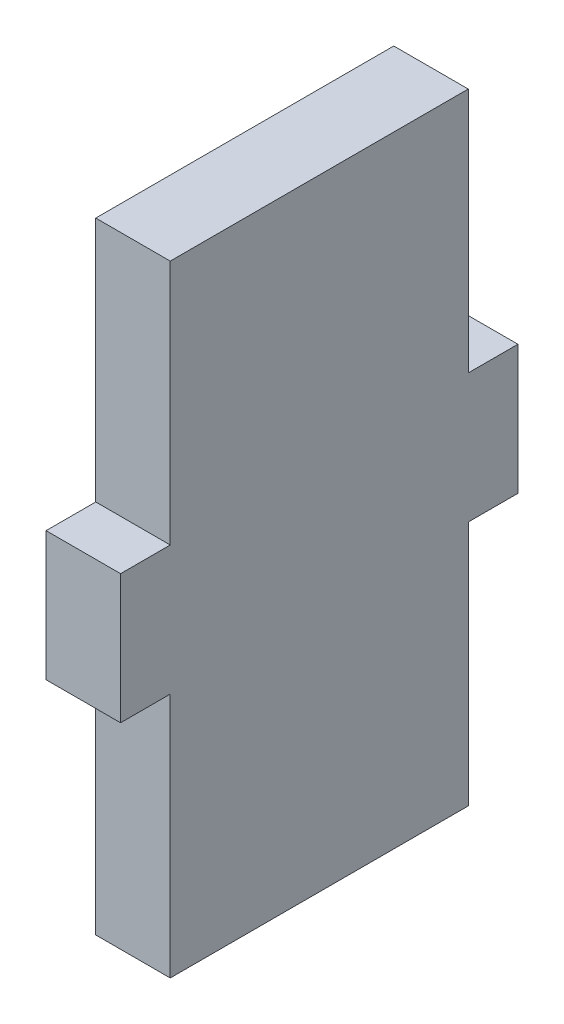
ISO-10303-21;
HEADER;
FILE_DESCRIPTION(('STEP AP214'),'2;1');
FILE_NAME('part.step','',(''),(''),'','','');
FILE_SCHEMA(('AUTOMOTIVE_DESIGN { 1 0 10303 214 1 1 1 1 }'));
ENDSEC;
DATA;
#1=APPLICATION_CONTEXT('core data for automotive mechanical design processes');
#2=APPLICATION_PROTOCOL_DEFINITION('international standard','automotive_design',2000,#1);
#3=PRODUCT_CONTEXT('',#1,'mechanical');
#4=PRODUCT('Part','Part','',(#3));
#5=PRODUCT_RELATED_PRODUCT_CATEGORY('part','',(#4));
#6=PRODUCT_DEFINITION_FORMATION('','',#4);
#7=PRODUCT_DEFINITION_CONTEXT('part definition',#1,'design');
#8=PRODUCT_DEFINITION('design','',#6,#7);
#9=PRODUCT_DEFINITION_SHAPE('','',#8);
#10=(LENGTH_UNIT() NAMED_UNIT(*) SI_UNIT(.MILLI.,.METRE.));
#11=(NAMED_UNIT(*) PLANE_ANGLE_UNIT() SI_UNIT($,.RADIAN.));
#12=(NAMED_UNIT(*) SI_UNIT($,.STERADIAN.) SOLID_ANGLE_UNIT());
#13=UNCERTAINTY_MEASURE_WITH_UNIT(LENGTH_MEASURE(1.E-05),#10,'distance_accuracy_value','');
#14=(GEOMETRIC_REPRESENTATION_CONTEXT(3) GLOBAL_UNCERTAINTY_ASSIGNED_CONTEXT((#13)) GLOBAL_UNIT_ASSIGNED_CONTEXT((#10,
#11,#12)) REPRESENTATION_CONTEXT('',''));
#15=CARTESIAN_POINT('',(0.,0.,0.));
#16=DIRECTION('',(0.,0.,1.));
#17=DIRECTION('',(1.,0.,0.));
#18=AXIS2_PLACEMENT_3D('',#15,#16,#17);
#19=CARTESIAN_POINT('',(435.5,-62.5,-40.000000000001));
#20=DIRECTION('',(0.,0.,1.));
#21=DIRECTION('',(1.,0.,0.));
#22=AXIS2_PLACEMENT_3D('',#19,#20,#21);
#23=PLANE('',#22);
#24=DIRECTION('',(1.,0.,0.));
#25=VECTOR('',#24,1.);
#26=CARTESIAN_POINT('',(392.643223445632,13.0000000000001,-40.000000000001));
#27=LINE('',#26,#25);
#28=CARTESIAN_POINT('',(420.5,13.0000000000001,-40.000000000001));
#29=VERTEX_POINT('',#28);
#30=CARTESIAN_POINT('',(435.5,13.0000000000001,-40.0000000000009));
#31=VERTEX_POINT('',#30);
#32=EDGE_CURVE('E48',#29,#31,#27,.T.);
#33=ORIENTED_EDGE('',*,*,#32,.F.);
#34=DIRECTION('',(0.,1.,0.));
#35=VECTOR('',#34,1.);
#36=CARTESIAN_POINT('',(420.5,-62.5,-40.0000000000011));
#37=LINE('',#36,#35);
#38=CARTESIAN_POINT('',(420.5,62.5,-40.000000000001));
#39=VERTEX_POINT('',#38);
#40=EDGE_CURVE('E190',#29,#39,#37,.T.);
#41=ORIENTED_EDGE('',*,*,#40,.T.);
#42=DIRECTION('',(1.,0.,0.));
#43=VECTOR('',#42,1.);
#44=CARTESIAN_POINT('',(435.5,62.5,-40.000000000001));
#45=LINE('',#44,#43);
#46=CARTESIAN_POINT('',(435.5,62.5,-40.000000000001));
#47=VERTEX_POINT('',#46);
#48=EDGE_CURVE('E122',#39,#47,#45,.T.);
#49=ORIENTED_EDGE('',*,*,#48,.T.);
#50=DIRECTION('',(0.,1.,0.));
#51=VECTOR('',#50,1.);
#52=CARTESIAN_POINT('',(435.5,-62.5,-40.000000000001));
#53=LINE('',#52,#51);
#54=EDGE_CURVE('E41',#31,#47,#53,.T.);
#55=ORIENTED_EDGE('',*,*,#54,.F.);
#56=EDGE_LOOP('',(#33,#41,#49,#55));
#57=FACE_BOUND('',#56,.T.);
#58=ADVANCED_FACE('F33',(#57),#23,.F.);
#59=CARTESIAN_POINT('',(420.5,-62.5,20.));
#60=DIRECTION('',(0.,0.,-1.));
#61=DIRECTION('',(-1.,0.,0.));
#62=AXIS2_PLACEMENT_3D('',#59,#60,#61);
#63=PLANE('',#62);
#64=DIRECTION('',(1.,0.,0.));
#65=VECTOR('',#64,1.);
#66=CARTESIAN_POINT('',(392.643223445632,-13.0000000000001,20.));
#67=LINE('',#66,#65);
#68=CARTESIAN_POINT('',(420.5,-13.0000000000001,20.));
#69=VERTEX_POINT('',#68);
#70=CARTESIAN_POINT('',(435.5,-13.0000000000001,20.0000000000001));
#71=VERTEX_POINT('',#70);
#72=EDGE_CURVE('E175',#69,#71,#67,.T.);
#73=ORIENTED_EDGE('',*,*,#72,.F.);
#74=DIRECTION('',(0.,1.,0.));
#75=VECTOR('',#74,1.);
#76=CARTESIAN_POINT('',(420.5,-62.5,20.));
#77=LINE('',#76,#75);
#78=CARTESIAN_POINT('',(420.5,-62.5,20.));
#79=VERTEX_POINT('',#78);
#80=EDGE_CURVE('E201',#79,#69,#77,.T.);
#81=ORIENTED_EDGE('',*,*,#80,.F.);
#82=DIRECTION('',(-1.,0.,0.));
#83=VECTOR('',#82,1.);
#84=CARTESIAN_POINT('',(420.5,-62.5,20.));
#85=LINE('',#84,#83);
#86=CARTESIAN_POINT('',(435.5,-62.5,20.));
#87=VERTEX_POINT('',#86);
#88=EDGE_CURVE('E186',#87,#79,#85,.T.);
#89=ORIENTED_EDGE('',*,*,#88,.F.);
#90=DIRECTION('',(0.,1.,0.));
#91=VECTOR('',#90,1.);
#92=CARTESIAN_POINT('',(435.5,-62.5,20.));
#93=LINE('',#92,#91);
#94=EDGE_CURVE('E127',#87,#71,#93,.T.);
#95=ORIENTED_EDGE('',*,*,#94,.T.);
#96=EDGE_LOOP('',(#73,#81,#89,#95));
#97=FACE_BOUND('',#96,.T.);
#98=ADVANCED_FACE('F232',(#97),#63,.F.);
#99=CARTESIAN_POINT('',(420.5,-62.5,-40.0000000000011));
#100=VERTEX_POINT('',#99);
#101=CARTESIAN_POINT('',(420.5,-13.0000000000001,-40.0000000000011));
#102=VERTEX_POINT('',#101);
#103=EDGE_CURVE('E56',#100,#102,#37,.T.);
#104=ORIENTED_EDGE('',*,*,#103,.T.);
#105=DIRECTION('',(1.,0.,0.));
#106=VECTOR('',#105,1.);
#107=CARTESIAN_POINT('',(392.643223445632,-13.0000000000001,-40.0000000000011));
#108=LINE('',#107,#106);
#109=CARTESIAN_POINT('',(435.5,-13.0000000000001,-40.000000000001));
#110=VERTEX_POINT('',#109);
#111=EDGE_CURVE('E136',#102,#110,#108,.T.);
#112=ORIENTED_EDGE('',*,*,#111,.T.);
#113=CARTESIAN_POINT('',(435.5,-62.5,-40.000000000001));
#114=VERTEX_POINT('',#113);
#115=EDGE_CURVE('E11',#114,#110,#53,.T.);
#116=ORIENTED_EDGE('',*,*,#115,.F.);
#117=DIRECTION('',(1.,0.,0.));
#118=VECTOR('',#117,1.);
#119=CARTESIAN_POINT('',(435.5,-62.5,-40.000000000001));
#120=LINE('',#119,#118);
#121=EDGE_CURVE('E180',#100,#114,#120,.T.);
#122=ORIENTED_EDGE('',*,*,#121,.F.);
#123=EDGE_LOOP('',(#104,#112,#116,#122));
#124=FACE_BOUND('',#123,.T.);
#125=ADVANCED_FACE('F35',(#124),#23,.F.);
#126=CARTESIAN_POINT('',(435.5,-62.5,-40.000000000001));
#127=DIRECTION('',(-1.,0.,0.));
#128=DIRECTION('',(0.,0.,1.));
#129=AXIS2_PLACEMENT_3D('',#126,#127,#128);
#130=PLANE('',#129);
#131=DIRECTION('',(0.,0.,1.));
#132=VECTOR('',#131,1.);
#133=CARTESIAN_POINT('',(435.5,62.5,-40.000000000001));
#134=LINE('',#133,#132);
#135=CARTESIAN_POINT('',(435.5,62.5,20.0000000000001));
#136=VERTEX_POINT('',#135);
#137=EDGE_CURVE('E192',#47,#136,#134,.T.);
#138=ORIENTED_EDGE('',*,*,#137,.T.);
#139=CARTESIAN_POINT('',(435.5,13.0000000000001,20.0000000000001));
#140=VERTEX_POINT('',#139);
#141=EDGE_CURVE('E203',#140,#136,#93,.T.);
#142=ORIENTED_EDGE('',*,*,#141,.F.);
#143=DIRECTION('',(0.,0.,1.));
#144=VECTOR('',#143,1.);
#145=CARTESIAN_POINT('',(435.5,13.0000000000001,30.0000000000002));
#146=LINE('',#145,#144);
#147=CARTESIAN_POINT('',(435.5,13.0000000000001,30.0000000000002));
#148=VERTEX_POINT('',#147);
#149=EDGE_CURVE('E168',#140,#148,#146,.T.);
#150=ORIENTED_EDGE('',*,*,#149,.T.);
#151=DIRECTION('',(0.,-1.,0.));
#152=VECTOR('',#151,1.);
#153=CARTESIAN_POINT('',(435.5,13.0000000000001,30.0000000000002));
#154=LINE('',#153,#152);
#155=CARTESIAN_POINT('',(435.5,-13.0000000000001,30.0000000000001));
#156=VERTEX_POINT('',#155);
#157=EDGE_CURVE('E162',#148,#156,#154,.T.);
#158=ORIENTED_EDGE('',*,*,#157,.T.);
#159=DIRECTION('',(0.,0.,-1.));
#160=VECTOR('',#159,1.);
#161=CARTESIAN_POINT('',(435.5,-13.0000000000001,30.0000000000001));
#162=LINE('',#161,#160);
#163=EDGE_CURVE('E165',#156,#71,#162,.T.);
#164=ORIENTED_EDGE('',*,*,#163,.T.);
#165=ORIENTED_EDGE('',*,*,#94,.F.);
#166=DIRECTION('',(0.,0.,1.));
#167=VECTOR('',#166,1.);
#168=CARTESIAN_POINT('',(435.5,-62.5,-40.000000000001));
#169=LINE('',#168,#167);
#170=EDGE_CURVE('E183',#114,#87,#169,.T.);
#171=ORIENTED_EDGE('',*,*,#170,.F.);
#172=ORIENTED_EDGE('',*,*,#115,.T.);
#173=DIRECTION('',(0.,0.,-1.));
#174=VECTOR('',#173,1.);
#175=CARTESIAN_POINT('',(435.5,-13.0000000000001,-50.0000000000009));
#176=LINE('',#175,#174);
#177=CARTESIAN_POINT('',(435.5,-13.0000000000001,-50.0000000000009));
#178=VERTEX_POINT('',#177);
#179=EDGE_CURVE('E142',#110,#178,#176,.T.);
#180=ORIENTED_EDGE('',*,*,#179,.T.);
#181=DIRECTION('',(0.,1.,0.));
#182=VECTOR('',#181,1.);
#183=CARTESIAN_POINT('',(435.5,13.0000000000001,-50.0000000000009));
#184=LINE('',#183,#182);
#185=CARTESIAN_POINT('',(435.5,13.0000000000001,-50.0000000000009));
#186=VERTEX_POINT('',#185);
#187=EDGE_CURVE('E137',#178,#186,#184,.T.);
#188=ORIENTED_EDGE('',*,*,#187,.T.);
#189=DIRECTION('',(0.,0.,1.));
#190=VECTOR('',#189,1.);
#191=CARTESIAN_POINT('',(435.5,13.0000000000001,-50.0000000000009));
#192=LINE('',#191,#190);
#193=EDGE_CURVE('E133',#186,#31,#192,.T.);
#194=ORIENTED_EDGE('',*,*,#193,.T.);
#195=ORIENTED_EDGE('',*,*,#54,.T.);
#196=EDGE_LOOP('',(#138,#142,#150,#158,#164,#165,#171,#172,#180,#188,#194,#195));
#197=FACE_BOUND('',#196,.T.);
#198=ADVANCED_FACE('F139',(#197),#130,.F.);
#199=CARTESIAN_POINT('',(420.5,13.0000000000001,20.));
#200=VERTEX_POINT('',#199);
#201=CARTESIAN_POINT('',(420.5,62.5,20.));
#202=VERTEX_POINT('',#201);
#203=EDGE_CURVE('E200',#200,#202,#77,.T.);
#204=ORIENTED_EDGE('',*,*,#203,.F.);
#205=DIRECTION('',(1.,0.,0.));
#206=VECTOR('',#205,1.);
#207=CARTESIAN_POINT('',(392.643223445632,13.0000000000001,20.));
#208=LINE('',#207,#206);
#209=EDGE_CURVE('E173',#200,#140,#208,.T.);
#210=ORIENTED_EDGE('',*,*,#209,.T.);
#211=ORIENTED_EDGE('',*,*,#141,.T.);
#212=DIRECTION('',(-1.,0.,0.));
#213=VECTOR('',#212,1.);
#214=CARTESIAN_POINT('',(420.5,62.5,20.));
#215=LINE('',#214,#213);
#216=EDGE_CURVE('E194',#136,#202,#215,.T.);
#217=ORIENTED_EDGE('',*,*,#216,.T.);
#218=EDGE_LOOP('',(#204,#210,#211,#217));
#219=FACE_BOUND('',#218,.T.);
#220=ADVANCED_FACE('F209',(#219),#63,.F.);
#221=CARTESIAN_POINT('',(420.5,-62.5,-40.0000000000011));
#222=DIRECTION('',(1.,0.,0.));
#223=DIRECTION('',(0.,0.,-1.));
#224=AXIS2_PLACEMENT_3D('',#221,#222,#223);
#225=PLANE('',#224);
#226=DIRECTION('',(0.,0.,-1.));
#227=VECTOR('',#226,1.);
#228=CARTESIAN_POINT('',(420.5,62.5,-40.000000000001));
#229=LINE('',#228,#227);
#230=EDGE_CURVE('E184',#202,#39,#229,.T.);
#231=ORIENTED_EDGE('',*,*,#230,.T.);
#232=ORIENTED_EDGE('',*,*,#40,.F.);
#233=DIRECTION('',(0.,0.,-1.));
#234=VECTOR('',#233,1.);
#235=CARTESIAN_POINT('',(420.5,13.0000000000001,-50.0000000000009));
#236=LINE('',#235,#234);
#237=CARTESIAN_POINT('',(420.5,13.0000000000001,-50.0000000000009));
#238=VERTEX_POINT('',#237);
#239=EDGE_CURVE('E135',#29,#238,#236,.T.);
#240=ORIENTED_EDGE('',*,*,#239,.T.);
#241=DIRECTION('',(0.,-1.,0.));
#242=VECTOR('',#241,1.);
#243=CARTESIAN_POINT('',(420.5,13.0000000000001,-50.0000000000009));
#244=LINE('',#243,#242);
#245=CARTESIAN_POINT('',(420.5,-13.0000000000001,-50.0000000000011));
#246=VERTEX_POINT('',#245);
#247=EDGE_CURVE('E246',#238,#246,#244,.T.);
#248=ORIENTED_EDGE('',*,*,#247,.T.);
#249=DIRECTION('',(0.,0.,1.));
#250=VECTOR('',#249,1.);
#251=CARTESIAN_POINT('',(420.5,-13.0000000000001,-50.000000000001));
#252=LINE('',#251,#250);
#253=EDGE_CURVE('E151',#246,#102,#252,.T.);
#254=ORIENTED_EDGE('',*,*,#253,.T.);
#255=ORIENTED_EDGE('',*,*,#103,.F.);
#256=DIRECTION('',(0.,0.,-1.));
#257=VECTOR('',#256,1.);
#258=CARTESIAN_POINT('',(420.5,-62.5,-40.0000000000011));
#259=LINE('',#258,#257);
#260=EDGE_CURVE('E188',#79,#100,#259,.T.);
#261=ORIENTED_EDGE('',*,*,#260,.F.);
#262=ORIENTED_EDGE('',*,*,#80,.T.);
#263=DIRECTION('',(0.,0.,1.));
#264=VECTOR('',#263,1.);
#265=CARTESIAN_POINT('',(420.5,-13.0000000000001,30.0000000000001));
#266=LINE('',#265,#264);
#267=CARTESIAN_POINT('',(420.5,-13.0000000000001,30.0000000000001));
#268=VERTEX_POINT('',#267);
#269=EDGE_CURVE('E161',#69,#268,#266,.T.);
#270=ORIENTED_EDGE('',*,*,#269,.T.);
#271=DIRECTION('',(0.,1.,0.));
#272=VECTOR('',#271,1.);
#273=CARTESIAN_POINT('',(420.5,13.0000000000001,30.0000000000001));
#274=LINE('',#273,#272);
#275=CARTESIAN_POINT('',(420.5,13.0000000000001,30.0000000000002));
#276=VERTEX_POINT('',#275);
#277=EDGE_CURVE('E158',#268,#276,#274,.T.);
#278=ORIENTED_EDGE('',*,*,#277,.T.);
#279=DIRECTION('',(0.,0.,-1.));
#280=VECTOR('',#279,1.);
#281=CARTESIAN_POINT('',(420.5,13.0000000000001,30.0000000000001));
#282=LINE('',#281,#280);
#283=EDGE_CURVE('E155',#276,#200,#282,.T.);
#284=ORIENTED_EDGE('',*,*,#283,.T.);
#285=ORIENTED_EDGE('',*,*,#203,.T.);
#286=EDGE_LOOP('',(#231,#232,#240,#248,#254,#255,#261,#262,#270,#278,#284,#285));
#287=FACE_BOUND('',#286,.T.);
#288=ADVANCED_FACE('F217',(#287),#225,.F.);
#289=CARTESIAN_POINT('',(7.50000000000012,-62.5,-30.0000000000005));
#290=DIRECTION('',(0.,1.,0.));
#291=DIRECTION('',(0.,0.,1.));
#292=AXIS2_PLACEMENT_3D('',#289,#290,#291);
#293=PLANE('',#292);
#294=ORIENTED_EDGE('',*,*,#121,.T.);
#295=ORIENTED_EDGE('',*,*,#170,.T.);
#296=ORIENTED_EDGE('',*,*,#88,.T.);
#297=ORIENTED_EDGE('',*,*,#260,.T.);
#298=EDGE_LOOP('',(#294,#295,#296,#297));
#299=FACE_BOUND('',#298,.T.);
#300=ADVANCED_FACE('F235',(#299),#293,.F.);
#301=CARTESIAN_POINT('',(7.50000000000012,62.5,-30.0000000000005));
#302=DIRECTION('',(0.,1.,0.));
#303=DIRECTION('',(0.,0.,1.));
#304=AXIS2_PLACEMENT_3D('',#301,#302,#303);
#305=PLANE('',#304);
#306=ORIENTED_EDGE('',*,*,#48,.F.);
#307=ORIENTED_EDGE('',*,*,#230,.F.);
#308=ORIENTED_EDGE('',*,*,#216,.F.);
#309=ORIENTED_EDGE('',*,*,#137,.F.);
#310=EDGE_LOOP('',(#306,#307,#308,#309));
#311=FACE_BOUND('',#310,.T.);
#312=ADVANCED_FACE('F215',(#311),#305,.T.);
#313=CARTESIAN_POINT('',(392.643223445631,13.0000000000001,30.));
#314=DIRECTION('',(0.,0.,1.));
#315=DIRECTION('',(1.,0.,0.));
#316=AXIS2_PLACEMENT_3D('',#313,#314,#315);
#317=PLANE('',#316);
#318=ORIENTED_EDGE('',*,*,#277,.F.);
#319=DIRECTION('',(1.,0.,0.));
#320=VECTOR('',#319,1.);
#321=CARTESIAN_POINT('',(392.643223445631,-13.0000000000001,30.));
#322=LINE('',#321,#320);
#323=EDGE_CURVE('E171',#268,#156,#322,.T.);
#324=ORIENTED_EDGE('',*,*,#323,.T.);
#325=ORIENTED_EDGE('',*,*,#157,.F.);
#326=DIRECTION('',(1.,0.,0.));
#327=VECTOR('',#326,1.);
#328=CARTESIAN_POINT('',(392.643223445631,13.0000000000001,30.));
#329=LINE('',#328,#327);
#330=EDGE_CURVE('E159',#276,#148,#329,.T.);
#331=ORIENTED_EDGE('',*,*,#330,.F.);
#332=EDGE_LOOP('',(#318,#324,#325,#331));
#333=FACE_BOUND('',#332,.T.);
#334=ADVANCED_FACE('F226',(#333),#317,.T.);
#335=CARTESIAN_POINT('',(392.643223445631,13.0000000000001,30.));
#336=DIRECTION('',(0.,1.,0.));
#337=DIRECTION('',(0.,0.,1.));
#338=AXIS2_PLACEMENT_3D('',#335,#336,#337);
#339=PLANE('',#338);
#340=ORIENTED_EDGE('',*,*,#283,.F.);
#341=ORIENTED_EDGE('',*,*,#330,.T.);
#342=ORIENTED_EDGE('',*,*,#149,.F.);
#343=ORIENTED_EDGE('',*,*,#209,.F.);
#344=EDGE_LOOP('',(#340,#341,#342,#343));
#345=FACE_BOUND('',#344,.T.);
#346=ADVANCED_FACE('F222',(#345),#339,.T.);
#347=CARTESIAN_POINT('',(392.643223445631,-13.0000000000001,30.));
#348=DIRECTION('',(0.,-1.,0.));
#349=DIRECTION('',(0.,0.,-1.));
#350=AXIS2_PLACEMENT_3D('',#347,#348,#349);
#351=PLANE('',#350);
#352=ORIENTED_EDGE('',*,*,#269,.F.);
#353=ORIENTED_EDGE('',*,*,#72,.T.);
#354=ORIENTED_EDGE('',*,*,#163,.F.);
#355=ORIENTED_EDGE('',*,*,#323,.F.);
#356=EDGE_LOOP('',(#352,#353,#354,#355));
#357=FACE_BOUND('',#356,.T.);
#358=ADVANCED_FACE('F230',(#357),#351,.T.);
#359=CARTESIAN_POINT('',(392.643223445632,13.0000000000001,-50.000000000001));
#360=DIRECTION('',(0.,1.,0.));
#361=DIRECTION('',(0.,0.,1.));
#362=AXIS2_PLACEMENT_3D('',#359,#360,#361);
#363=PLANE('',#362);
#364=ORIENTED_EDGE('',*,*,#239,.F.);
#365=ORIENTED_EDGE('',*,*,#32,.T.);
#366=ORIENTED_EDGE('',*,*,#193,.F.);
#367=DIRECTION('',(1.,0.,0.));
#368=VECTOR('',#367,1.);
#369=CARTESIAN_POINT('',(392.643223445632,13.0000000000001,-50.000000000001));
#370=LINE('',#369,#368);
#371=EDGE_CURVE('E149',#238,#186,#370,.T.);
#372=ORIENTED_EDGE('',*,*,#371,.F.);
#373=EDGE_LOOP('',(#364,#365,#366,#372));
#374=FACE_BOUND('',#373,.T.);
#375=ADVANCED_FACE('F131',(#374),#363,.T.);
#376=CARTESIAN_POINT('',(392.643223445632,13.0000000000001,-50.000000000001));
#377=DIRECTION('',(0.,0.,-1.));
#378=DIRECTION('',(-1.,0.,0.));
#379=AXIS2_PLACEMENT_3D('',#376,#377,#378);
#380=PLANE('',#379);
#381=ORIENTED_EDGE('',*,*,#247,.F.);
#382=ORIENTED_EDGE('',*,*,#371,.T.);
#383=ORIENTED_EDGE('',*,*,#187,.F.);
#384=DIRECTION('',(1.,0.,0.));
#385=VECTOR('',#384,1.);
#386=CARTESIAN_POINT('',(392.643223445632,-13.0000000000001,-50.0000000000011));
#387=LINE('',#386,#385);
#388=EDGE_CURVE('E152',#246,#178,#387,.T.);
#389=ORIENTED_EDGE('',*,*,#388,.F.);
#390=EDGE_LOOP('',(#381,#382,#383,#389));
#391=FACE_BOUND('',#390,.T.);
#392=ADVANCED_FACE('F245',(#391),#380,.T.);
#393=CARTESIAN_POINT('',(392.643223445632,-13.0000000000001,-50.0000000000011));
#394=DIRECTION('',(0.,-1.,0.));
#395=DIRECTION('',(0.,0.,-1.));
#396=AXIS2_PLACEMENT_3D('',#393,#394,#395);
#397=PLANE('',#396);
#398=ORIENTED_EDGE('',*,*,#253,.F.);
#399=ORIENTED_EDGE('',*,*,#388,.T.);
#400=ORIENTED_EDGE('',*,*,#179,.F.);
#401=ORIENTED_EDGE('',*,*,#111,.F.);
#402=EDGE_LOOP('',(#398,#399,#400,#401));
#403=FACE_BOUND('',#402,.T.);
#404=ADVANCED_FACE('F241',(#403),#397,.T.);
#405=CLOSED_SHELL('',(#58,#98,#125,#198,#220,#288,#300,#312,#334,#346,#358,#375,#392,#404));
#406=MANIFOLD_SOLID_BREP('B2',#405);
#407=ADVANCED_BREP_SHAPE_REPRESENTATION('',(#18,#406),#14);
#408=SHAPE_DEFINITION_REPRESENTATION(#9,#407);
ENDSEC;
END-ISO-10303-21;
